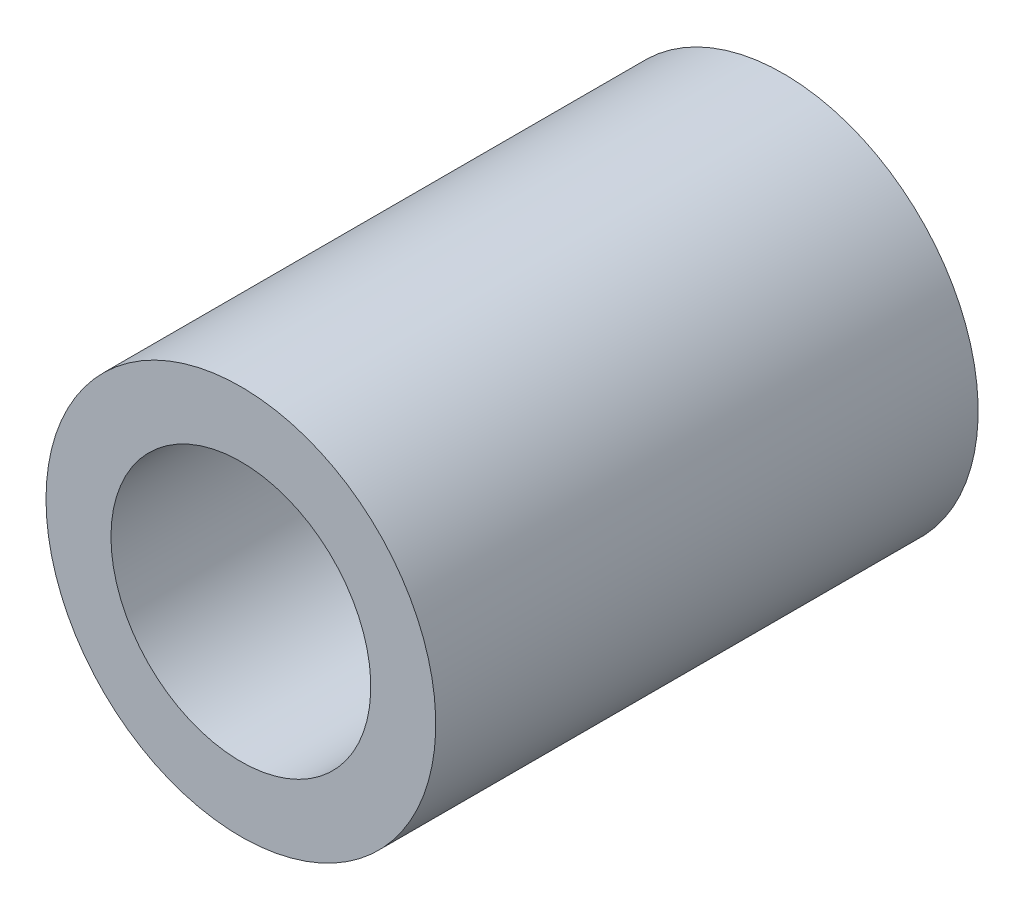
ISO-10303-21;
HEADER;
FILE_DESCRIPTION(('STEP AP214'),'2;1');
FILE_NAME('part.step','',(''),(''),'','','');
FILE_SCHEMA(('AUTOMOTIVE_DESIGN { 1 0 10303 214 1 1 1 1 }'));
ENDSEC;
DATA;
#1=APPLICATION_CONTEXT('core data for automotive mechanical design processes');
#2=APPLICATION_PROTOCOL_DEFINITION('international standard','automotive_design',2000,#1);
#3=PRODUCT_CONTEXT('',#1,'mechanical');
#4=PRODUCT('Part','Part','',(#3));
#5=PRODUCT_RELATED_PRODUCT_CATEGORY('part','',(#4));
#6=PRODUCT_DEFINITION_FORMATION('','',#4);
#7=PRODUCT_DEFINITION_CONTEXT('part definition',#1,'design');
#8=PRODUCT_DEFINITION('design','',#6,#7);
#9=PRODUCT_DEFINITION_SHAPE('','',#8);
#10=(LENGTH_UNIT() NAMED_UNIT(*) SI_UNIT(.MILLI.,.METRE.));
#11=(NAMED_UNIT(*) PLANE_ANGLE_UNIT() SI_UNIT($,.RADIAN.));
#12=(NAMED_UNIT(*) SI_UNIT($,.STERADIAN.) SOLID_ANGLE_UNIT());
#13=UNCERTAINTY_MEASURE_WITH_UNIT(LENGTH_MEASURE(1.E-05),#10,'distance_accuracy_value','');
#14=(GEOMETRIC_REPRESENTATION_CONTEXT(3) GLOBAL_UNCERTAINTY_ASSIGNED_CONTEXT((#13)) GLOBAL_UNIT_ASSIGNED_CONTEXT((#10,
#11,#12)) REPRESENTATION_CONTEXT('',''));
#15=CARTESIAN_POINT('',(0.,0.,0.));
#16=DIRECTION('',(0.,0.,1.));
#17=DIRECTION('',(1.,0.,0.));
#18=AXIS2_PLACEMENT_3D('',#15,#16,#17);
#19=CARTESIAN_POINT('',(31.63,4.,-0.01));
#20=DIRECTION('',(0.,0.,-1.));
#21=DIRECTION('',(-1.,0.,0.));
#22=AXIS2_PLACEMENT_3D('',#19,#20,#21);
#23=CYLINDRICAL_SURFACE('',#22,0.4);
#24=CARTESIAN_POINT('',(31.63,4.,1.66));
#25=DIRECTION('',(0.,0.,-1.));
#26=DIRECTION('',(-1.,0.,0.));
#27=AXIS2_PLACEMENT_3D('',#24,#25,#26);
#28=CIRCLE('',#27,0.4);
#29=CARTESIAN_POINT('',(31.23,4.,1.66));
#30=VERTEX_POINT('',#29);
#31=EDGE_CURVE('E27',#30,#30,#28,.T.);
#32=ORIENTED_EDGE('',*,*,#31,.F.);
#33=EDGE_LOOP('',(#32));
#34=FACE_BOUND('',#33,.T.);
#35=CARTESIAN_POINT('',(31.63,4.,-0.01));
#36=DIRECTION('',(0.,0.,-1.));
#37=DIRECTION('',(-1.,0.,0.));
#38=AXIS2_PLACEMENT_3D('',#35,#36,#37);
#39=CIRCLE('',#38,0.4);
#40=CARTESIAN_POINT('',(31.23,4.,-0.01));
#41=VERTEX_POINT('',#40);
#42=EDGE_CURVE('E18',#41,#41,#39,.T.);
#43=ORIENTED_EDGE('',*,*,#42,.T.);
#44=EDGE_LOOP('',(#43));
#45=FACE_BOUND('',#44,.T.);
#46=ADVANCED_FACE('F15',(#34,#45),#23,.F.);
#47=CARTESIAN_POINT('',(31.63,4.,-0.01));
#48=DIRECTION('',(0.,0.,1.));
#49=DIRECTION('',(1.,0.,0.));
#50=AXIS2_PLACEMENT_3D('',#47,#48,#49);
#51=PLANE('',#50);
#52=ORIENTED_EDGE('',*,*,#42,.F.);
#53=EDGE_LOOP('',(#52));
#54=FACE_BOUND('',#53,.T.);
#55=CARTESIAN_POINT('',(31.63,4.,-0.01));
#56=DIRECTION('',(0.,0.,-1.));
#57=DIRECTION('',(-1.,0.,0.));
#58=AXIS2_PLACEMENT_3D('',#55,#56,#57);
#59=CIRCLE('',#58,0.6);
#60=CARTESIAN_POINT('',(31.03,4.,-0.01));
#61=VERTEX_POINT('',#60);
#62=EDGE_CURVE('E22',#61,#61,#59,.F.);
#63=ORIENTED_EDGE('',*,*,#62,.F.);
#64=EDGE_LOOP('',(#63));
#65=FACE_BOUND('',#64,.T.);
#66=ADVANCED_FACE('F36',(#54,#65),#51,.F.);
#67=CARTESIAN_POINT('',(31.63,4.,1.66));
#68=DIRECTION('',(0.,0.,1.));
#69=DIRECTION('',(1.,0.,0.));
#70=AXIS2_PLACEMENT_3D('',#67,#68,#69);
#71=PLANE('',#70);
#72=ORIENTED_EDGE('',*,*,#31,.T.);
#73=EDGE_LOOP('',(#72));
#74=FACE_BOUND('',#73,.T.);
#75=CARTESIAN_POINT('',(31.63,4.,1.66));
#76=DIRECTION('',(0.,0.,-1.));
#77=DIRECTION('',(-1.,0.,0.));
#78=AXIS2_PLACEMENT_3D('',#75,#76,#77);
#79=CIRCLE('',#78,0.6);
#80=CARTESIAN_POINT('',(31.03,4.,1.66));
#81=VERTEX_POINT('',#80);
#82=EDGE_CURVE('E10',#81,#81,#79,.T.);
#83=ORIENTED_EDGE('',*,*,#82,.F.);
#84=EDGE_LOOP('',(#83));
#85=FACE_BOUND('',#84,.T.);
#86=ADVANCED_FACE('F39',(#74,#85),#71,.T.);
#87=CARTESIAN_POINT('',(31.63,4.,-0.01));
#88=DIRECTION('',(0.,0.,-1.));
#89=DIRECTION('',(-1.,0.,0.));
#90=AXIS2_PLACEMENT_3D('',#87,#88,#89);
#91=CYLINDRICAL_SURFACE('',#90,0.6);
#92=ORIENTED_EDGE('',*,*,#82,.T.);
#93=EDGE_LOOP('',(#92));
#94=FACE_BOUND('',#93,.T.);
#95=ORIENTED_EDGE('',*,*,#62,.T.);
#96=EDGE_LOOP('',(#95));
#97=FACE_BOUND('',#96,.T.);
#98=ADVANCED_FACE('F42',(#94,#97),#91,.T.);
#99=CLOSED_SHELL('',(#46,#66,#86,#98));
#100=MANIFOLD_SOLID_BREP('B1',#99);
#101=ADVANCED_BREP_SHAPE_REPRESENTATION('',(#18,#100),#14);
#102=SHAPE_DEFINITION_REPRESENTATION(#9,#101);
ENDSEC;
END-ISO-10303-21;
